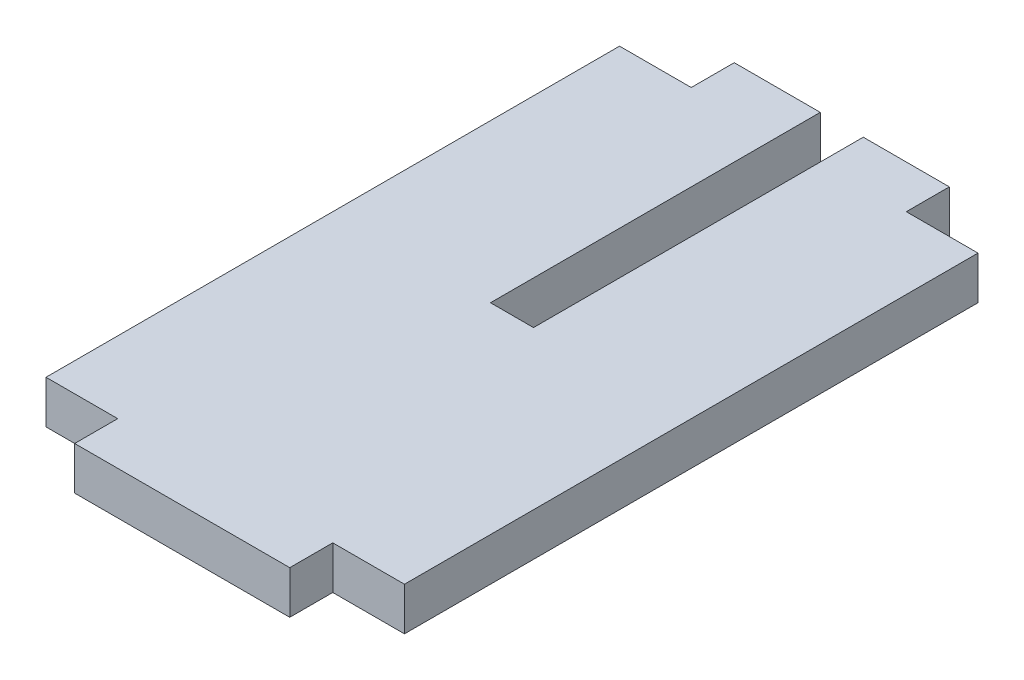
ISO-10303-21;
HEADER;
FILE_DESCRIPTION(('STEP AP214'),'2;1');
FILE_NAME('part.step','',(''),(''),'','','');
FILE_SCHEMA(('AUTOMOTIVE_DESIGN { 1 0 10303 214 1 1 1 1 }'));
ENDSEC;
DATA;
#1=APPLICATION_CONTEXT('core data for automotive mechanical design processes');
#2=APPLICATION_PROTOCOL_DEFINITION('international standard','automotive_design',2000,#1);
#3=PRODUCT_CONTEXT('',#1,'mechanical');
#4=PRODUCT('Part','Part','',(#3));
#5=PRODUCT_RELATED_PRODUCT_CATEGORY('part','',(#4));
#6=PRODUCT_DEFINITION_FORMATION('','',#4);
#7=PRODUCT_DEFINITION_CONTEXT('part definition',#1,'design');
#8=PRODUCT_DEFINITION('design','',#6,#7);
#9=PRODUCT_DEFINITION_SHAPE('','',#8);
#10=(LENGTH_UNIT() NAMED_UNIT(*) SI_UNIT(.MILLI.,.METRE.));
#11=(NAMED_UNIT(*) PLANE_ANGLE_UNIT() SI_UNIT($,.RADIAN.));
#12=(NAMED_UNIT(*) SI_UNIT($,.STERADIAN.) SOLID_ANGLE_UNIT());
#13=UNCERTAINTY_MEASURE_WITH_UNIT(LENGTH_MEASURE(1.E-05),#10,'distance_accuracy_value','');
#14=(GEOMETRIC_REPRESENTATION_CONTEXT(3) GLOBAL_UNCERTAINTY_ASSIGNED_CONTEXT((#13)) GLOBAL_UNIT_ASSIGNED_CONTEXT((#10,
#11,#12)) REPRESENTATION_CONTEXT('',''));
#15=CARTESIAN_POINT('',(0.,0.,0.));
#16=DIRECTION('',(0.,0.,1.));
#17=DIRECTION('',(1.,0.,0.));
#18=AXIS2_PLACEMENT_3D('',#15,#16,#17);
#19=CARTESIAN_POINT('',(-15.,6.,-46.));
#20=DIRECTION('',(0.,0.,1.));
#21=DIRECTION('',(1.,0.,0.));
#22=AXIS2_PLACEMENT_3D('',#19,#20,#21);
#23=PLANE('',#22);
#24=DIRECTION('',(-1.,0.,0.));
#25=VECTOR('',#24,1.);
#26=CARTESIAN_POINT('',(-15.,6.,-46.));
#27=LINE('',#26,#25);
#28=CARTESIAN_POINT('',(-3.,6.,-46.));
#29=VERTEX_POINT('',#28);
#30=CARTESIAN_POINT('',(-15.,6.,-46.));
#31=VERTEX_POINT('',#30);
#32=EDGE_CURVE('E144',#29,#31,#27,.T.);
#33=ORIENTED_EDGE('',*,*,#32,.F.);
#34=DIRECTION('',(0.,1.,0.));
#35=VECTOR('',#34,1.);
#36=CARTESIAN_POINT('',(-3.,0.,-46.));
#37=LINE('',#36,#35);
#38=CARTESIAN_POINT('',(-3.,0.,-46.));
#39=VERTEX_POINT('',#38);
#40=EDGE_CURVE('E178',#39,#29,#37,.T.);
#41=ORIENTED_EDGE('',*,*,#40,.F.);
#42=DIRECTION('',(-1.,0.,0.));
#43=VECTOR('',#42,1.);
#44=CARTESIAN_POINT('',(-15.,0.,-46.));
#45=LINE('',#44,#43);
#46=CARTESIAN_POINT('',(-15.,0.,-46.));
#47=VERTEX_POINT('',#46);
#48=EDGE_CURVE('E161',#39,#47,#45,.T.);
#49=ORIENTED_EDGE('',*,*,#48,.T.);
#50=DIRECTION('',(0.,-1.,0.));
#51=VECTOR('',#50,1.);
#52=CARTESIAN_POINT('',(-15.,6.,-46.));
#53=LINE('',#52,#51);
#54=EDGE_CURVE('E159',#31,#47,#53,.T.);
#55=ORIENTED_EDGE('',*,*,#54,.F.);
#56=EDGE_LOOP('',(#33,#41,#49,#55));
#57=FACE_BOUND('',#56,.T.);
#58=ADVANCED_FACE('F38',(#57),#23,.F.);
#59=CARTESIAN_POINT('',(-25.,6.,40.));
#60=DIRECTION('',(1.,0.,0.));
#61=DIRECTION('',(0.,0.,-1.));
#62=AXIS2_PLACEMENT_3D('',#59,#60,#61);
#63=PLANE('',#62);
#64=DIRECTION('',(0.,0.,1.));
#65=VECTOR('',#64,1.);
#66=CARTESIAN_POINT('',(-25.,0.,40.));
#67=LINE('',#66,#65);
#68=CARTESIAN_POINT('',(-25.,0.,-40.));
#69=VERTEX_POINT('',#68);
#70=CARTESIAN_POINT('',(-25.,0.,40.));
#71=VERTEX_POINT('',#70);
#72=EDGE_CURVE('E174',#69,#71,#67,.T.);
#73=ORIENTED_EDGE('',*,*,#72,.T.);
#74=DIRECTION('',(0.,-1.,0.));
#75=VECTOR('',#74,1.);
#76=CARTESIAN_POINT('',(-25.,6.,40.));
#77=LINE('',#76,#75);
#78=CARTESIAN_POINT('',(-25.,6.,40.));
#79=VERTEX_POINT('',#78);
#80=EDGE_CURVE('E11',#79,#71,#77,.T.);
#81=ORIENTED_EDGE('',*,*,#80,.F.);
#82=DIRECTION('',(0.,0.,1.));
#83=VECTOR('',#82,1.);
#84=CARTESIAN_POINT('',(-25.,6.,40.));
#85=LINE('',#84,#83);
#86=CARTESIAN_POINT('',(-25.,6.,-40.));
#87=VERTEX_POINT('',#86);
#88=EDGE_CURVE('E200',#87,#79,#85,.T.);
#89=ORIENTED_EDGE('',*,*,#88,.F.);
#90=DIRECTION('',(0.,-1.,0.));
#91=VECTOR('',#90,1.);
#92=CARTESIAN_POINT('',(-25.,6.,-40.));
#93=LINE('',#92,#91);
#94=EDGE_CURVE('E169',#87,#69,#93,.T.);
#95=ORIENTED_EDGE('',*,*,#94,.T.);
#96=EDGE_LOOP('',(#73,#81,#89,#95));
#97=FACE_BOUND('',#96,.T.);
#98=ADVANCED_FACE('F40',(#97),#63,.F.);
#99=CARTESIAN_POINT('',(-25.,6.,40.));
#100=DIRECTION('',(0.,0.,-1.));
#101=DIRECTION('',(-1.,0.,0.));
#102=AXIS2_PLACEMENT_3D('',#99,#100,#101);
#103=PLANE('',#102);
#104=DIRECTION('',(1.,0.,0.));
#105=VECTOR('',#104,1.);
#106=CARTESIAN_POINT('',(-25.,0.,40.));
#107=LINE('',#106,#105);
#108=CARTESIAN_POINT('',(-15.,0.,40.));
#109=VERTEX_POINT('',#108);
#110=EDGE_CURVE('E177',#71,#109,#107,.T.);
#111=ORIENTED_EDGE('',*,*,#110,.T.);
#112=DIRECTION('',(0.,-1.,0.));
#113=VECTOR('',#112,1.);
#114=CARTESIAN_POINT('',(-15.,6.,40.));
#115=LINE('',#114,#113);
#116=CARTESIAN_POINT('',(-15.,6.,40.));
#117=VERTEX_POINT('',#116);
#118=EDGE_CURVE('E46',#117,#109,#115,.T.);
#119=ORIENTED_EDGE('',*,*,#118,.F.);
#120=DIRECTION('',(1.,0.,0.));
#121=VECTOR('',#120,1.);
#122=CARTESIAN_POINT('',(-25.,6.,40.));
#123=LINE('',#122,#121);
#124=EDGE_CURVE('E115',#79,#117,#123,.T.);
#125=ORIENTED_EDGE('',*,*,#124,.F.);
#126=ORIENTED_EDGE('',*,*,#80,.T.);
#127=EDGE_LOOP('',(#111,#119,#125,#126));
#128=FACE_BOUND('',#127,.T.);
#129=ADVANCED_FACE('F288',(#128),#103,.F.);
#130=CARTESIAN_POINT('',(-15.,6.,40.));
#131=DIRECTION('',(1.,0.,0.));
#132=DIRECTION('',(0.,0.,-1.));
#133=AXIS2_PLACEMENT_3D('',#130,#131,#132);
#134=PLANE('',#133);
#135=DIRECTION('',(0.,0.,1.));
#136=VECTOR('',#135,1.);
#137=CARTESIAN_POINT('',(-15.,0.,40.));
#138=LINE('',#137,#136);
#139=CARTESIAN_POINT('',(-15.,0.,46.));
#140=VERTEX_POINT('',#139);
#141=EDGE_CURVE('E180',#109,#140,#138,.T.);
#142=ORIENTED_EDGE('',*,*,#141,.T.);
#143=DIRECTION('',(0.,-1.,0.));
#144=VECTOR('',#143,1.);
#145=CARTESIAN_POINT('',(-15.,6.,46.));
#146=LINE('',#145,#144);
#147=CARTESIAN_POINT('',(-15.,6.,46.));
#148=VERTEX_POINT('',#147);
#149=EDGE_CURVE('E220',#148,#140,#146,.T.);
#150=ORIENTED_EDGE('',*,*,#149,.F.);
#151=DIRECTION('',(0.,0.,1.));
#152=VECTOR('',#151,1.);
#153=CARTESIAN_POINT('',(-15.,6.,40.));
#154=LINE('',#153,#152);
#155=EDGE_CURVE('E228',#117,#148,#154,.T.);
#156=ORIENTED_EDGE('',*,*,#155,.F.);
#157=ORIENTED_EDGE('',*,*,#118,.T.);
#158=EDGE_LOOP('',(#142,#150,#156,#157));
#159=FACE_BOUND('',#158,.T.);
#160=ADVANCED_FACE('F226',(#159),#134,.F.);
#161=CARTESIAN_POINT('',(-15.,6.,46.));
#162=DIRECTION('',(0.,0.,-1.));
#163=DIRECTION('',(-1.,0.,0.));
#164=AXIS2_PLACEMENT_3D('',#161,#162,#163);
#165=PLANE('',#164);
#166=DIRECTION('',(1.,0.,0.));
#167=VECTOR('',#166,1.);
#168=CARTESIAN_POINT('',(-15.,0.,46.));
#169=LINE('',#168,#167);
#170=CARTESIAN_POINT('',(15.,0.,46.));
#171=VERTEX_POINT('',#170);
#172=EDGE_CURVE('E182',#140,#171,#169,.T.);
#173=ORIENTED_EDGE('',*,*,#172,.T.);
#174=DIRECTION('',(0.,-1.,0.));
#175=VECTOR('',#174,1.);
#176=CARTESIAN_POINT('',(15.,6.,46.));
#177=LINE('',#176,#175);
#178=CARTESIAN_POINT('',(15.,6.,46.));
#179=VERTEX_POINT('',#178);
#180=EDGE_CURVE('E217',#179,#171,#177,.T.);
#181=ORIENTED_EDGE('',*,*,#180,.F.);
#182=DIRECTION('',(1.,0.,0.));
#183=VECTOR('',#182,1.);
#184=CARTESIAN_POINT('',(-15.,6.,46.));
#185=LINE('',#184,#183);
#186=EDGE_CURVE('E247',#148,#179,#185,.T.);
#187=ORIENTED_EDGE('',*,*,#186,.F.);
#188=ORIENTED_EDGE('',*,*,#149,.T.);
#189=EDGE_LOOP('',(#173,#181,#187,#188));
#190=FACE_BOUND('',#189,.T.);
#191=ADVANCED_FACE('F238',(#190),#165,.F.);
#192=CARTESIAN_POINT('',(15.,6.,40.));
#193=DIRECTION('',(-1.,0.,0.));
#194=DIRECTION('',(0.,0.,1.));
#195=AXIS2_PLACEMENT_3D('',#192,#193,#194);
#196=PLANE('',#195);
#197=DIRECTION('',(0.,0.,-1.));
#198=VECTOR('',#197,1.);
#199=CARTESIAN_POINT('',(15.,0.,40.));
#200=LINE('',#199,#198);
#201=CARTESIAN_POINT('',(15.,0.,40.));
#202=VERTEX_POINT('',#201);
#203=EDGE_CURVE('E184',#171,#202,#200,.T.);
#204=ORIENTED_EDGE('',*,*,#203,.T.);
#205=DIRECTION('',(0.,-1.,0.));
#206=VECTOR('',#205,1.);
#207=CARTESIAN_POINT('',(15.,6.,40.));
#208=LINE('',#207,#206);
#209=CARTESIAN_POINT('',(15.,6.,40.));
#210=VERTEX_POINT('',#209);
#211=EDGE_CURVE('E214',#210,#202,#208,.T.);
#212=ORIENTED_EDGE('',*,*,#211,.F.);
#213=DIRECTION('',(0.,0.,-1.));
#214=VECTOR('',#213,1.);
#215=CARTESIAN_POINT('',(15.,6.,40.));
#216=LINE('',#215,#214);
#217=EDGE_CURVE('E244',#179,#210,#216,.T.);
#218=ORIENTED_EDGE('',*,*,#217,.F.);
#219=ORIENTED_EDGE('',*,*,#180,.T.);
#220=EDGE_LOOP('',(#204,#212,#218,#219));
#221=FACE_BOUND('',#220,.T.);
#222=ADVANCED_FACE('F242',(#221),#196,.F.);
#223=CARTESIAN_POINT('',(15.,6.,40.));
#224=DIRECTION('',(0.,0.,-1.));
#225=DIRECTION('',(-1.,0.,0.));
#226=AXIS2_PLACEMENT_3D('',#223,#224,#225);
#227=PLANE('',#226);
#228=DIRECTION('',(1.,0.,0.));
#229=VECTOR('',#228,1.);
#230=CARTESIAN_POINT('',(15.,0.,40.));
#231=LINE('',#230,#229);
#232=CARTESIAN_POINT('',(25.,0.,40.));
#233=VERTEX_POINT('',#232);
#234=EDGE_CURVE('E186',#202,#233,#231,.T.);
#235=ORIENTED_EDGE('',*,*,#234,.T.);
#236=DIRECTION('',(0.,-1.,0.));
#237=VECTOR('',#236,1.);
#238=CARTESIAN_POINT('',(25.,6.,40.));
#239=LINE('',#238,#237);
#240=CARTESIAN_POINT('',(25.,6.,40.));
#241=VERTEX_POINT('',#240);
#242=EDGE_CURVE('E211',#241,#233,#239,.T.);
#243=ORIENTED_EDGE('',*,*,#242,.F.);
#244=DIRECTION('',(1.,0.,0.));
#245=VECTOR('',#244,1.);
#246=CARTESIAN_POINT('',(15.,6.,40.));
#247=LINE('',#246,#245);
#248=EDGE_CURVE('E246',#210,#241,#247,.T.);
#249=ORIENTED_EDGE('',*,*,#248,.F.);
#250=ORIENTED_EDGE('',*,*,#211,.T.);
#251=EDGE_LOOP('',(#235,#243,#249,#250));
#252=FACE_BOUND('',#251,.T.);
#253=ADVANCED_FACE('F317',(#252),#227,.F.);
#254=CARTESIAN_POINT('',(25.,6.,40.));
#255=DIRECTION('',(-1.,0.,0.));
#256=DIRECTION('',(0.,0.,1.));
#257=AXIS2_PLACEMENT_3D('',#254,#255,#256);
#258=PLANE('',#257);
#259=DIRECTION('',(0.,0.,-1.));
#260=VECTOR('',#259,1.);
#261=CARTESIAN_POINT('',(25.,0.,40.));
#262=LINE('',#261,#260);
#263=CARTESIAN_POINT('',(25.,0.,-40.));
#264=VERTEX_POINT('',#263);
#265=EDGE_CURVE('E188',#233,#264,#262,.T.);
#266=ORIENTED_EDGE('',*,*,#265,.T.);
#267=DIRECTION('',(0.,-1.,0.));
#268=VECTOR('',#267,1.);
#269=CARTESIAN_POINT('',(25.,6.,-40.));
#270=LINE('',#269,#268);
#271=CARTESIAN_POINT('',(25.,6.,-40.));
#272=VERTEX_POINT('',#271);
#273=EDGE_CURVE('E208',#272,#264,#270,.T.);
#274=ORIENTED_EDGE('',*,*,#273,.F.);
#275=DIRECTION('',(0.,0.,-1.));
#276=VECTOR('',#275,1.);
#277=CARTESIAN_POINT('',(25.,6.,40.));
#278=LINE('',#277,#276);
#279=EDGE_CURVE('E249',#241,#272,#278,.T.);
#280=ORIENTED_EDGE('',*,*,#279,.F.);
#281=ORIENTED_EDGE('',*,*,#242,.T.);
#282=EDGE_LOOP('',(#266,#274,#280,#281));
#283=FACE_BOUND('',#282,.T.);
#284=ADVANCED_FACE('F311',(#283),#258,.F.);
#285=CARTESIAN_POINT('',(15.,6.,-40.));
#286=DIRECTION('',(0.,0.,1.));
#287=DIRECTION('',(1.,0.,0.));
#288=AXIS2_PLACEMENT_3D('',#285,#286,#287);
#289=PLANE('',#288);
#290=DIRECTION('',(-1.,0.,0.));
#291=VECTOR('',#290,1.);
#292=CARTESIAN_POINT('',(15.,0.,-40.));
#293=LINE('',#292,#291);
#294=CARTESIAN_POINT('',(15.,0.,-40.));
#295=VERTEX_POINT('',#294);
#296=EDGE_CURVE('E190',#264,#295,#293,.T.);
#297=ORIENTED_EDGE('',*,*,#296,.T.);
#298=DIRECTION('',(0.,-1.,0.));
#299=VECTOR('',#298,1.);
#300=CARTESIAN_POINT('',(15.,6.,-40.));
#301=LINE('',#300,#299);
#302=CARTESIAN_POINT('',(15.,6.,-40.));
#303=VERTEX_POINT('',#302);
#304=EDGE_CURVE('E205',#303,#295,#301,.T.);
#305=ORIENTED_EDGE('',*,*,#304,.F.);
#306=DIRECTION('',(-1.,0.,0.));
#307=VECTOR('',#306,1.);
#308=CARTESIAN_POINT('',(15.,6.,-40.));
#309=LINE('',#308,#307);
#310=EDGE_CURVE('E255',#272,#303,#309,.T.);
#311=ORIENTED_EDGE('',*,*,#310,.F.);
#312=ORIENTED_EDGE('',*,*,#273,.T.);
#313=EDGE_LOOP('',(#297,#305,#311,#312));
#314=FACE_BOUND('',#313,.T.);
#315=ADVANCED_FACE('F307',(#314),#289,.F.);
#316=CARTESIAN_POINT('',(15.,6.,-46.));
#317=DIRECTION('',(-1.,0.,0.));
#318=DIRECTION('',(0.,0.,1.));
#319=AXIS2_PLACEMENT_3D('',#316,#317,#318);
#320=PLANE('',#319);
#321=DIRECTION('',(0.,0.,-1.));
#322=VECTOR('',#321,1.);
#323=CARTESIAN_POINT('',(15.,0.,-46.));
#324=LINE('',#323,#322);
#325=CARTESIAN_POINT('',(15.,0.,-46.));
#326=VERTEX_POINT('',#325);
#327=EDGE_CURVE('E192',#295,#326,#324,.T.);
#328=ORIENTED_EDGE('',*,*,#327,.T.);
#329=DIRECTION('',(0.,-1.,0.));
#330=VECTOR('',#329,1.);
#331=CARTESIAN_POINT('',(15.,6.,-46.));
#332=LINE('',#331,#330);
#333=CARTESIAN_POINT('',(15.,6.,-46.));
#334=VERTEX_POINT('',#333);
#335=EDGE_CURVE('E164',#334,#326,#332,.T.);
#336=ORIENTED_EDGE('',*,*,#335,.F.);
#337=DIRECTION('',(0.,0.,-1.));
#338=VECTOR('',#337,1.);
#339=CARTESIAN_POINT('',(15.,6.,-46.));
#340=LINE('',#339,#338);
#341=EDGE_CURVE('E156',#303,#334,#340,.T.);
#342=ORIENTED_EDGE('',*,*,#341,.F.);
#343=ORIENTED_EDGE('',*,*,#304,.T.);
#344=EDGE_LOOP('',(#328,#336,#342,#343));
#345=FACE_BOUND('',#344,.T.);
#346=ADVANCED_FACE('F264',(#345),#320,.F.);
#347=CARTESIAN_POINT('',(2.99999999999998,0.,-46.));
#348=VERTEX_POINT('',#347);
#349=EDGE_CURVE('E194',#326,#348,#45,.T.);
#350=ORIENTED_EDGE('',*,*,#349,.T.);
#351=DIRECTION('',(0.,1.,0.));
#352=VECTOR('',#351,1.);
#353=CARTESIAN_POINT('',(2.99999999999998,0.,-46.));
#354=LINE('',#353,#352);
#355=CARTESIAN_POINT('',(2.99999999999998,6.,-46.));
#356=VERTEX_POINT('',#355);
#357=EDGE_CURVE('E270',#348,#356,#354,.T.);
#358=ORIENTED_EDGE('',*,*,#357,.T.);
#359=EDGE_CURVE('E155',#334,#356,#27,.T.);
#360=ORIENTED_EDGE('',*,*,#359,.F.);
#361=ORIENTED_EDGE('',*,*,#335,.T.);
#362=EDGE_LOOP('',(#350,#358,#360,#361));
#363=FACE_BOUND('',#362,.T.);
#364=ADVANCED_FACE('F269',(#363),#23,.F.);
#365=CARTESIAN_POINT('',(-15.,6.,-40.));
#366=DIRECTION('',(1.,0.,0.));
#367=DIRECTION('',(0.,0.,-1.));
#368=AXIS2_PLACEMENT_3D('',#365,#366,#367);
#369=PLANE('',#368);
#370=DIRECTION('',(0.,0.,1.));
#371=VECTOR('',#370,1.);
#372=CARTESIAN_POINT('',(-15.,0.,-40.));
#373=LINE('',#372,#371);
#374=CARTESIAN_POINT('',(-15.,0.,-40.));
#375=VERTEX_POINT('',#374);
#376=EDGE_CURVE('E197',#47,#375,#373,.T.);
#377=ORIENTED_EDGE('',*,*,#376,.T.);
#378=DIRECTION('',(0.,-1.,0.));
#379=VECTOR('',#378,1.);
#380=CARTESIAN_POINT('',(-15.,6.,-40.));
#381=LINE('',#380,#379);
#382=CARTESIAN_POINT('',(-15.,6.,-40.));
#383=VERTEX_POINT('',#382);
#384=EDGE_CURVE('E165',#383,#375,#381,.T.);
#385=ORIENTED_EDGE('',*,*,#384,.F.);
#386=DIRECTION('',(0.,0.,1.));
#387=VECTOR('',#386,1.);
#388=CARTESIAN_POINT('',(-15.,6.,-40.));
#389=LINE('',#388,#387);
#390=EDGE_CURVE('E149',#31,#383,#389,.T.);
#391=ORIENTED_EDGE('',*,*,#390,.F.);
#392=ORIENTED_EDGE('',*,*,#54,.T.);
#393=EDGE_LOOP('',(#377,#385,#391,#392));
#394=FACE_BOUND('',#393,.T.);
#395=ADVANCED_FACE('F167',(#394),#369,.F.);
#396=CARTESIAN_POINT('',(-25.,6.,-40.));
#397=DIRECTION('',(0.,0.,1.));
#398=DIRECTION('',(1.,0.,0.));
#399=AXIS2_PLACEMENT_3D('',#396,#397,#398);
#400=PLANE('',#399);
#401=DIRECTION('',(-1.,0.,0.));
#402=VECTOR('',#401,1.);
#403=CARTESIAN_POINT('',(-25.,0.,-40.));
#404=LINE('',#403,#402);
#405=EDGE_CURVE('E107',#375,#69,#404,.T.);
#406=ORIENTED_EDGE('',*,*,#405,.T.);
#407=ORIENTED_EDGE('',*,*,#94,.F.);
#408=DIRECTION('',(-1.,0.,0.));
#409=VECTOR('',#408,1.);
#410=CARTESIAN_POINT('',(-25.,6.,-40.));
#411=LINE('',#410,#409);
#412=EDGE_CURVE('E62',#383,#87,#411,.T.);
#413=ORIENTED_EDGE('',*,*,#412,.F.);
#414=ORIENTED_EDGE('',*,*,#384,.T.);
#415=EDGE_LOOP('',(#406,#407,#413,#414));
#416=FACE_BOUND('',#415,.T.);
#417=ADVANCED_FACE('F306',(#416),#400,.F.);
#418=CARTESIAN_POINT('',(0.,6.,0.));
#419=DIRECTION('',(0.,-1.,0.));
#420=DIRECTION('',(0.,0.,-1.));
#421=AXIS2_PLACEMENT_3D('',#418,#419,#420);
#422=PLANE('',#421);
#423=DIRECTION('',(1.,0.,0.));
#424=VECTOR('',#423,1.);
#425=CARTESIAN_POINT('',(-3.,6.,0.));
#426=LINE('',#425,#424);
#427=CARTESIAN_POINT('',(-3.,6.,0.));
#428=VERTEX_POINT('',#427);
#429=CARTESIAN_POINT('',(3.,6.,0.));
#430=VERTEX_POINT('',#429);
#431=EDGE_CURVE('E399',#428,#430,#426,.T.);
#432=ORIENTED_EDGE('',*,*,#431,.F.);
#433=DIRECTION('',(0.,0.,1.));
#434=VECTOR('',#433,1.);
#435=CARTESIAN_POINT('',(-3.,6.,0.));
#436=LINE('',#435,#434);
#437=EDGE_CURVE('E152',#29,#428,#436,.T.);
#438=ORIENTED_EDGE('',*,*,#437,.F.);
#439=ORIENTED_EDGE('',*,*,#32,.T.);
#440=ORIENTED_EDGE('',*,*,#390,.T.);
#441=ORIENTED_EDGE('',*,*,#412,.T.);
#442=ORIENTED_EDGE('',*,*,#88,.T.);
#443=ORIENTED_EDGE('',*,*,#124,.T.);
#444=ORIENTED_EDGE('',*,*,#155,.T.);
#445=ORIENTED_EDGE('',*,*,#186,.T.);
#446=ORIENTED_EDGE('',*,*,#217,.T.);
#447=ORIENTED_EDGE('',*,*,#248,.T.);
#448=ORIENTED_EDGE('',*,*,#279,.T.);
#449=ORIENTED_EDGE('',*,*,#310,.T.);
#450=ORIENTED_EDGE('',*,*,#341,.T.);
#451=ORIENTED_EDGE('',*,*,#359,.T.);
#452=DIRECTION('',(0.,0.,-1.));
#453=VECTOR('',#452,1.);
#454=CARTESIAN_POINT('',(3.,6.,0.));
#455=LINE('',#454,#453);
#456=EDGE_CURVE('E405',#430,#356,#455,.T.);
#457=ORIENTED_EDGE('',*,*,#456,.F.);
#458=EDGE_LOOP('',(#432,#438,#439,#440,#441,#442,#443,#444,#445,#446,#447,#448,#449,#450,#451,#457));
#459=FACE_BOUND('',#458,.T.);
#460=ADVANCED_FACE('F147',(#459),#422,.F.);
#461=CARTESIAN_POINT('',(0.,0.,0.));
#462=DIRECTION('',(0.,-1.,0.));
#463=DIRECTION('',(0.,0.,-1.));
#464=AXIS2_PLACEMENT_3D('',#461,#462,#463);
#465=PLANE('',#464);
#466=DIRECTION('',(0.,0.,1.));
#467=VECTOR('',#466,1.);
#468=CARTESIAN_POINT('',(-3.,0.,0.));
#469=LINE('',#468,#467);
#470=CARTESIAN_POINT('',(-3.,0.,0.));
#471=VERTEX_POINT('',#470);
#472=EDGE_CURVE('E407',#39,#471,#469,.T.);
#473=ORIENTED_EDGE('',*,*,#472,.T.);
#474=DIRECTION('',(1.,0.,0.));
#475=VECTOR('',#474,1.);
#476=CARTESIAN_POINT('',(-3.,0.,0.));
#477=LINE('',#476,#475);
#478=CARTESIAN_POINT('',(3.,0.,0.));
#479=VERTEX_POINT('',#478);
#480=EDGE_CURVE('E408',#471,#479,#477,.T.);
#481=ORIENTED_EDGE('',*,*,#480,.T.);
#482=DIRECTION('',(0.,0.,-1.));
#483=VECTOR('',#482,1.);
#484=CARTESIAN_POINT('',(3.,0.,0.));
#485=LINE('',#484,#483);
#486=EDGE_CURVE('E53',#479,#348,#485,.T.);
#487=ORIENTED_EDGE('',*,*,#486,.T.);
#488=ORIENTED_EDGE('',*,*,#349,.F.);
#489=ORIENTED_EDGE('',*,*,#327,.F.);
#490=ORIENTED_EDGE('',*,*,#296,.F.);
#491=ORIENTED_EDGE('',*,*,#265,.F.);
#492=ORIENTED_EDGE('',*,*,#234,.F.);
#493=ORIENTED_EDGE('',*,*,#203,.F.);
#494=ORIENTED_EDGE('',*,*,#172,.F.);
#495=ORIENTED_EDGE('',*,*,#141,.F.);
#496=ORIENTED_EDGE('',*,*,#110,.F.);
#497=ORIENTED_EDGE('',*,*,#72,.F.);
#498=ORIENTED_EDGE('',*,*,#405,.F.);
#499=ORIENTED_EDGE('',*,*,#376,.F.);
#500=ORIENTED_EDGE('',*,*,#48,.F.);
#501=EDGE_LOOP('',(#473,#481,#487,#488,#489,#490,#491,#492,#493,#494,#495,#496,#497,#498,#499,#500));
#502=FACE_BOUND('',#501,.T.);
#503=ADVANCED_FACE('F232',(#502),#465,.T.);
#504=CARTESIAN_POINT('',(-3.,0.,0.));
#505=DIRECTION('',(-1.,0.,0.));
#506=DIRECTION('',(0.,0.,1.));
#507=AXIS2_PLACEMENT_3D('',#504,#505,#506);
#508=PLANE('',#507);
#509=ORIENTED_EDGE('',*,*,#437,.T.);
#510=DIRECTION('',(0.,1.,0.));
#511=VECTOR('',#510,1.);
#512=CARTESIAN_POINT('',(-3.,0.,0.));
#513=LINE('',#512,#511);
#514=EDGE_CURVE('E278',#471,#428,#513,.T.);
#515=ORIENTED_EDGE('',*,*,#514,.F.);
#516=ORIENTED_EDGE('',*,*,#472,.F.);
#517=ORIENTED_EDGE('',*,*,#40,.T.);
#518=EDGE_LOOP('',(#509,#515,#516,#517));
#519=FACE_BOUND('',#518,.T.);
#520=ADVANCED_FACE('F371',(#519),#508,.F.);
#521=CARTESIAN_POINT('',(3.,0.,0.));
#522=DIRECTION('',(1.,0.,0.));
#523=DIRECTION('',(0.,0.,-1.));
#524=AXIS2_PLACEMENT_3D('',#521,#522,#523);
#525=PLANE('',#524);
#526=ORIENTED_EDGE('',*,*,#456,.T.);
#527=ORIENTED_EDGE('',*,*,#357,.F.);
#528=ORIENTED_EDGE('',*,*,#486,.F.);
#529=DIRECTION('',(0.,1.,0.));
#530=VECTOR('',#529,1.);
#531=CARTESIAN_POINT('',(3.,0.,0.));
#532=LINE('',#531,#530);
#533=EDGE_CURVE('E274',#479,#430,#532,.T.);
#534=ORIENTED_EDGE('',*,*,#533,.T.);
#535=EDGE_LOOP('',(#526,#527,#528,#534));
#536=FACE_BOUND('',#535,.T.);
#537=ADVANCED_FACE('F381',(#536),#525,.F.);
#538=CARTESIAN_POINT('',(-3.,0.,0.));
#539=DIRECTION('',(0.,0.,1.));
#540=DIRECTION('',(1.,0.,0.));
#541=AXIS2_PLACEMENT_3D('',#538,#539,#540);
#542=PLANE('',#541);
#543=ORIENTED_EDGE('',*,*,#431,.T.);
#544=ORIENTED_EDGE('',*,*,#533,.F.);
#545=ORIENTED_EDGE('',*,*,#480,.F.);
#546=ORIENTED_EDGE('',*,*,#514,.T.);
#547=EDGE_LOOP('',(#543,#544,#545,#546));
#548=FACE_BOUND('',#547,.T.);
#549=ADVANCED_FACE('F389',(#548),#542,.F.);
#550=CLOSED_SHELL('',(#58,#98,#129,#160,#191,#222,#253,#284,#315,#346,#364,#395,#417,#460,#503,
#520,#537,#549));
#551=MANIFOLD_SOLID_BREP('B2',#550);
#552=ADVANCED_BREP_SHAPE_REPRESENTATION('',(#18,#551),#14);
#553=SHAPE_DEFINITION_REPRESENTATION(#9,#552);
ENDSEC;
END-ISO-10303-21;
